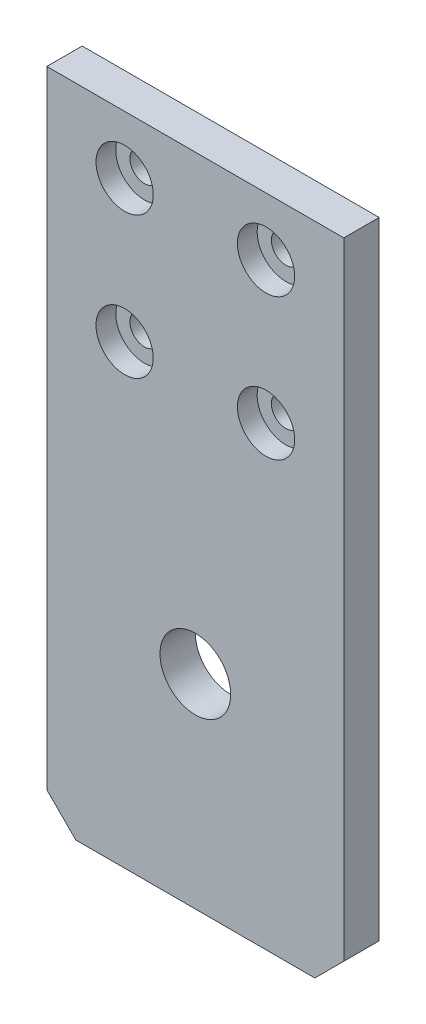
ISO-10303-21;
HEADER;
FILE_DESCRIPTION(('STEP AP214'),'2;1');
FILE_NAME('part.step','',(''),(''),'','','');
FILE_SCHEMA(('AUTOMOTIVE_DESIGN { 1 0 10303 214 1 1 1 1 }'));
ENDSEC;
DATA;
#1=APPLICATION_CONTEXT('core data for automotive mechanical design processes');
#2=APPLICATION_PROTOCOL_DEFINITION('international standard','automotive_design',2000,#1);
#3=PRODUCT_CONTEXT('',#1,'mechanical');
#4=PRODUCT('Part','Part','',(#3));
#5=PRODUCT_RELATED_PRODUCT_CATEGORY('part','',(#4));
#6=PRODUCT_DEFINITION_FORMATION('','',#4);
#7=PRODUCT_DEFINITION_CONTEXT('part definition',#1,'design');
#8=PRODUCT_DEFINITION('design','',#6,#7);
#9=PRODUCT_DEFINITION_SHAPE('','',#8);
#10=(LENGTH_UNIT() NAMED_UNIT(*) SI_UNIT(.MILLI.,.METRE.));
#11=(NAMED_UNIT(*) PLANE_ANGLE_UNIT() SI_UNIT($,.RADIAN.));
#12=(NAMED_UNIT(*) SI_UNIT($,.STERADIAN.) SOLID_ANGLE_UNIT());
#13=UNCERTAINTY_MEASURE_WITH_UNIT(LENGTH_MEASURE(1.E-05),#10,'distance_accuracy_value','');
#14=(GEOMETRIC_REPRESENTATION_CONTEXT(3) GLOBAL_UNCERTAINTY_ASSIGNED_CONTEXT((#13)) GLOBAL_UNIT_ASSIGNED_CONTEXT((#10,
#11,#12)) REPRESENTATION_CONTEXT('',''));
#15=CARTESIAN_POINT('',(0.,0.,0.));
#16=DIRECTION('',(0.,0.,1.));
#17=DIRECTION('',(1.,0.,0.));
#18=AXIS2_PLACEMENT_3D('',#15,#16,#17);
#19=CARTESIAN_POINT('',(31.,76.8,5.));
#20=DIRECTION('',(0.,0.,-1.));
#21=DIRECTION('',(-1.,0.,0.));
#22=AXIS2_PLACEMENT_3D('',#19,#20,#21);
#23=CYLINDRICAL_SURFACE('',#22,2.04999999999999);
#24=CARTESIAN_POINT('',(31.,76.8,0.));
#25=DIRECTION('',(0.,0.,1.));
#26=DIRECTION('',(1.,0.,0.));
#27=AXIS2_PLACEMENT_3D('',#24,#25,#26);
#28=CIRCLE('',#27,2.04999999999999);
#29=CARTESIAN_POINT('',(33.05,76.8,0.));
#30=VERTEX_POINT('',#29);
#31=EDGE_CURVE('E237',#30,#30,#28,.T.);
#32=ORIENTED_EDGE('',*,*,#31,.F.);
#33=EDGE_LOOP('',(#32));
#34=FACE_BOUND('',#33,.T.);
#35=CARTESIAN_POINT('',(31.,76.8,2.2));
#36=DIRECTION('',(0.,0.,1.));
#37=DIRECTION('',(1.,0.,0.));
#38=AXIS2_PLACEMENT_3D('',#35,#36,#37);
#39=CIRCLE('',#38,2.04999999999999);
#40=CARTESIAN_POINT('',(33.05,76.8,2.2));
#41=VERTEX_POINT('',#40);
#42=EDGE_CURVE('E137',#41,#41,#39,.T.);
#43=ORIENTED_EDGE('',*,*,#42,.T.);
#44=EDGE_LOOP('',(#43));
#45=FACE_BOUND('',#44,.T.);
#46=ADVANCED_FACE('F35',(#34,#45),#23,.F.);
#47=CARTESIAN_POINT('',(31.,56.8,5.));
#48=DIRECTION('',(0.,0.,-1.));
#49=DIRECTION('',(-1.,0.,0.));
#50=AXIS2_PLACEMENT_3D('',#47,#48,#49);
#51=CYLINDRICAL_SURFACE('',#50,2.04999999999999);
#52=CARTESIAN_POINT('',(31.,56.8,0.));
#53=DIRECTION('',(0.,0.,1.));
#54=DIRECTION('',(1.,0.,0.));
#55=AXIS2_PLACEMENT_3D('',#52,#53,#54);
#56=CIRCLE('',#55,2.04999999999999);
#57=CARTESIAN_POINT('',(33.05,56.8,0.));
#58=VERTEX_POINT('',#57);
#59=EDGE_CURVE('E234',#58,#58,#56,.T.);
#60=ORIENTED_EDGE('',*,*,#59,.F.);
#61=EDGE_LOOP('',(#60));
#62=FACE_BOUND('',#61,.T.);
#63=CARTESIAN_POINT('',(31.,56.8,2.2));
#64=DIRECTION('',(0.,0.,1.));
#65=DIRECTION('',(1.,0.,0.));
#66=AXIS2_PLACEMENT_3D('',#63,#64,#65);
#67=CIRCLE('',#66,2.04999999999999);
#68=CARTESIAN_POINT('',(33.05,56.8,2.2));
#69=VERTEX_POINT('',#68);
#70=EDGE_CURVE('E132',#69,#69,#67,.T.);
#71=ORIENTED_EDGE('',*,*,#70,.T.);
#72=EDGE_LOOP('',(#71));
#73=FACE_BOUND('',#72,.T.);
#74=ADVANCED_FACE('F175',(#62,#73),#51,.F.);
#75=CARTESIAN_POINT('',(11.,56.8,5.));
#76=DIRECTION('',(0.,0.,-1.));
#77=DIRECTION('',(-1.,0.,0.));
#78=AXIS2_PLACEMENT_3D('',#75,#76,#77);
#79=CYLINDRICAL_SURFACE('',#78,2.05000000000001);
#80=CARTESIAN_POINT('',(11.,56.8,0.));
#81=DIRECTION('',(0.,0.,1.));
#82=DIRECTION('',(1.,0.,0.));
#83=AXIS2_PLACEMENT_3D('',#80,#81,#82);
#84=CIRCLE('',#83,2.05000000000001);
#85=CARTESIAN_POINT('',(13.05,56.8,0.));
#86=VERTEX_POINT('',#85);
#87=EDGE_CURVE('E125',#86,#86,#84,.T.);
#88=ORIENTED_EDGE('',*,*,#87,.F.);
#89=EDGE_LOOP('',(#88));
#90=FACE_BOUND('',#89,.T.);
#91=CARTESIAN_POINT('',(11.,56.8,2.2));
#92=DIRECTION('',(0.,0.,1.));
#93=DIRECTION('',(1.,0.,0.));
#94=AXIS2_PLACEMENT_3D('',#91,#92,#93);
#95=CIRCLE('',#94,2.05000000000001);
#96=CARTESIAN_POINT('',(13.05,56.8,2.2));
#97=VERTEX_POINT('',#96);
#98=EDGE_CURVE('E127',#97,#97,#95,.T.);
#99=ORIENTED_EDGE('',*,*,#98,.T.);
#100=EDGE_LOOP('',(#99));
#101=FACE_BOUND('',#100,.T.);
#102=ADVANCED_FACE('F181',(#90,#101),#79,.F.);
#103=CARTESIAN_POINT('',(11.,76.8,5.));
#104=DIRECTION('',(0.,0.,-1.));
#105=DIRECTION('',(-1.,0.,0.));
#106=AXIS2_PLACEMENT_3D('',#103,#104,#105);
#107=CYLINDRICAL_SURFACE('',#106,2.04999999999999);
#108=CARTESIAN_POINT('',(11.,76.8,0.));
#109=DIRECTION('',(0.,0.,1.));
#110=DIRECTION('',(1.,0.,0.));
#111=AXIS2_PLACEMENT_3D('',#108,#109,#110);
#112=CIRCLE('',#111,2.04999999999999);
#113=CARTESIAN_POINT('',(13.05,76.8,0.));
#114=VERTEX_POINT('',#113);
#115=EDGE_CURVE('E118',#114,#114,#112,.T.);
#116=ORIENTED_EDGE('',*,*,#115,.F.);
#117=EDGE_LOOP('',(#116));
#118=FACE_BOUND('',#117,.T.);
#119=CARTESIAN_POINT('',(11.,76.8,2.2));
#120=DIRECTION('',(0.,0.,1.));
#121=DIRECTION('',(1.,0.,0.));
#122=AXIS2_PLACEMENT_3D('',#119,#120,#121);
#123=CIRCLE('',#122,2.04999999999999);
#124=CARTESIAN_POINT('',(13.05,76.8,2.2));
#125=VERTEX_POINT('',#124);
#126=EDGE_CURVE('E122',#125,#125,#123,.T.);
#127=ORIENTED_EDGE('',*,*,#126,.T.);
#128=EDGE_LOOP('',(#127));
#129=FACE_BOUND('',#128,.T.);
#130=ADVANCED_FACE('F188',(#118,#129),#107,.F.);
#131=CARTESIAN_POINT('',(0.,0.,5.));
#132=DIRECTION('',(0.,0.,1.));
#133=DIRECTION('',(1.,0.,0.));
#134=AXIS2_PLACEMENT_3D('',#131,#132,#133);
#135=PLANE('',#134);
#136=CARTESIAN_POINT('',(21.,21.08,5.));
#137=DIRECTION('',(0.,0.,1.));
#138=DIRECTION('',(1.,0.,0.));
#139=AXIS2_PLACEMENT_3D('',#136,#137,#138);
#140=CIRCLE('',#139,5.);
#141=CARTESIAN_POINT('',(26.,21.08,5.));
#142=VERTEX_POINT('',#141);
#143=EDGE_CURVE('E161',#142,#142,#140,.T.);
#144=ORIENTED_EDGE('',*,*,#143,.F.);
#145=EDGE_LOOP('',(#144));
#146=FACE_BOUND('',#145,.T.);
#147=CARTESIAN_POINT('',(31.,76.8,5.));
#148=DIRECTION('',(0.,0.,1.));
#149=DIRECTION('',(1.,0.,0.));
#150=AXIS2_PLACEMENT_3D('',#147,#148,#149);
#151=CIRCLE('',#150,4.04999999999999);
#152=CARTESIAN_POINT('',(35.05,76.8,5.));
#153=VERTEX_POINT('',#152);
#154=EDGE_CURVE('E213',#153,#153,#151,.T.);
#155=ORIENTED_EDGE('',*,*,#154,.F.);
#156=EDGE_LOOP('',(#155));
#157=FACE_BOUND('',#156,.T.);
#158=CARTESIAN_POINT('',(31.,56.8,5.));
#159=DIRECTION('',(0.,0.,1.));
#160=DIRECTION('',(1.,0.,0.));
#161=AXIS2_PLACEMENT_3D('',#158,#159,#160);
#162=CIRCLE('',#161,4.04999999999999);
#163=CARTESIAN_POINT('',(35.05,56.8,5.));
#164=VERTEX_POINT('',#163);
#165=EDGE_CURVE('E140',#164,#164,#162,.T.);
#166=ORIENTED_EDGE('',*,*,#165,.F.);
#167=EDGE_LOOP('',(#166));
#168=FACE_BOUND('',#167,.T.);
#169=CARTESIAN_POINT('',(11.,56.8,5.));
#170=DIRECTION('',(0.,0.,1.));
#171=DIRECTION('',(1.,0.,0.));
#172=AXIS2_PLACEMENT_3D('',#169,#170,#171);
#173=CIRCLE('',#172,4.05);
#174=CARTESIAN_POINT('',(15.05,56.8,5.));
#175=VERTEX_POINT('',#174);
#176=EDGE_CURVE('E135',#175,#175,#173,.T.);
#177=ORIENTED_EDGE('',*,*,#176,.F.);
#178=EDGE_LOOP('',(#177));
#179=FACE_BOUND('',#178,.T.);
#180=CARTESIAN_POINT('',(11.,76.8,5.));
#181=DIRECTION('',(0.,0.,1.));
#182=DIRECTION('',(1.,0.,0.));
#183=AXIS2_PLACEMENT_3D('',#180,#181,#182);
#184=CIRCLE('',#183,4.05);
#185=CARTESIAN_POINT('',(15.05,76.8,5.));
#186=VERTEX_POINT('',#185);
#187=EDGE_CURVE('E130',#186,#186,#184,.T.);
#188=ORIENTED_EDGE('',*,*,#187,.F.);
#189=EDGE_LOOP('',(#188));
#190=FACE_BOUND('',#189,.T.);
#191=DIRECTION('',(1.,0.,0.));
#192=VECTOR('',#191,1.);
#193=CARTESIAN_POINT('',(0.,-7.7,5.));
#194=LINE('',#193,#192);
#195=CARTESIAN_POINT('',(4.10000000000002,-7.7,5.));
#196=VERTEX_POINT('',#195);
#197=CARTESIAN_POINT('',(37.9,-7.7,5.));
#198=VERTEX_POINT('',#197);
#199=EDGE_CURVE('E162',#196,#198,#194,.T.);
#200=ORIENTED_EDGE('',*,*,#199,.T.);
#201=DIRECTION('',(0.707106781186546,0.707106781186549,0.));
#202=VECTOR('',#201,1.);
#203=CARTESIAN_POINT('',(22.8000000000001,-22.8,5.));
#204=LINE('',#203,#202);
#205=CARTESIAN_POINT('',(42.,-3.59999999999998,5.));
#206=VERTEX_POINT('',#205);
#207=EDGE_CURVE('E97',#198,#206,#204,.T.);
#208=ORIENTED_EDGE('',*,*,#207,.T.);
#209=DIRECTION('',(0.,1.,0.));
#210=VECTOR('',#209,1.);
#211=CARTESIAN_POINT('',(42.,85.,5.));
#212=LINE('',#211,#210);
#213=CARTESIAN_POINT('',(42.,85.,5.));
#214=VERTEX_POINT('',#213);
#215=EDGE_CURVE('E89',#206,#214,#212,.T.);
#216=ORIENTED_EDGE('',*,*,#215,.T.);
#217=DIRECTION('',(-1.,0.,0.));
#218=VECTOR('',#217,1.);
#219=CARTESIAN_POINT('',(0.,85.,5.));
#220=LINE('',#219,#218);
#221=CARTESIAN_POINT('',(0.,85.,5.));
#222=VERTEX_POINT('',#221);
#223=EDGE_CURVE('E95',#214,#222,#220,.T.);
#224=ORIENTED_EDGE('',*,*,#223,.T.);
#225=DIRECTION('',(0.,-1.,0.));
#226=VECTOR('',#225,1.);
#227=CARTESIAN_POINT('',(0.,85.,5.));
#228=LINE('',#227,#226);
#229=CARTESIAN_POINT('',(0.,-3.6,5.));
#230=VERTEX_POINT('',#229);
#231=EDGE_CURVE('E98',#222,#230,#228,.T.);
#232=ORIENTED_EDGE('',*,*,#231,.T.);
#233=DIRECTION('',(0.707106781186549,-0.707106781186546,0.));
#234=VECTOR('',#233,1.);
#235=CARTESIAN_POINT('',(-1.8,-1.8,5.));
#236=LINE('',#235,#234);
#237=EDGE_CURVE('E146',#230,#196,#236,.T.);
#238=ORIENTED_EDGE('',*,*,#237,.T.);
#239=EDGE_LOOP('',(#200,#208,#216,#224,#232,#238));
#240=FACE_BOUND('',#239,.T.);
#241=ADVANCED_FACE('F92',(#146,#157,#168,#179,#190,#240),#135,.T.);
#242=CARTESIAN_POINT('',(0.,0.,0.));
#243=DIRECTION('',(0.,0.,1.));
#244=DIRECTION('',(1.,0.,0.));
#245=AXIS2_PLACEMENT_3D('',#242,#243,#244);
#246=PLANE('',#245);
#247=CARTESIAN_POINT('',(21.,21.08,0.));
#248=DIRECTION('',(0.,0.,1.));
#249=DIRECTION('',(1.,0.,0.));
#250=AXIS2_PLACEMENT_3D('',#247,#248,#249);
#251=CIRCLE('',#250,5.);
#252=CARTESIAN_POINT('',(26.,21.08,0.));
#253=VERTEX_POINT('',#252);
#254=EDGE_CURVE('E210',#253,#253,#251,.T.);
#255=ORIENTED_EDGE('',*,*,#254,.T.);
#256=EDGE_LOOP('',(#255));
#257=FACE_BOUND('',#256,.T.);
#258=DIRECTION('',(0.,1.,0.));
#259=VECTOR('',#258,1.);
#260=CARTESIAN_POINT('',(42.,85.,0.));
#261=LINE('',#260,#259);
#262=CARTESIAN_POINT('',(42.,-3.59999999999997,0.));
#263=VERTEX_POINT('',#262);
#264=CARTESIAN_POINT('',(42.,85.,0.));
#265=VERTEX_POINT('',#264);
#266=EDGE_CURVE('E103',#263,#265,#261,.T.);
#267=ORIENTED_EDGE('',*,*,#266,.F.);
#268=DIRECTION('',(-0.707106781186546,-0.707106781186549,0.));
#269=VECTOR('',#268,1.);
#270=CARTESIAN_POINT('',(37.9,-7.7,0.));
#271=LINE('',#270,#269);
#272=CARTESIAN_POINT('',(37.9,-7.7,0.));
#273=VERTEX_POINT('',#272);
#274=EDGE_CURVE('E43',#263,#273,#271,.T.);
#275=ORIENTED_EDGE('',*,*,#274,.T.);
#276=DIRECTION('',(1.,0.,0.));
#277=VECTOR('',#276,1.);
#278=CARTESIAN_POINT('',(0.,-7.7,0.));
#279=LINE('',#278,#277);
#280=CARTESIAN_POINT('',(4.10000000000002,-7.7,0.));
#281=VERTEX_POINT('',#280);
#282=EDGE_CURVE('E154',#281,#273,#279,.T.);
#283=ORIENTED_EDGE('',*,*,#282,.F.);
#284=DIRECTION('',(-0.707106781186549,0.707106781186546,0.));
#285=VECTOR('',#284,1.);
#286=CARTESIAN_POINT('',(0.,-3.59999999999999,0.));
#287=LINE('',#286,#285);
#288=CARTESIAN_POINT('',(0.,-3.6,0.));
#289=VERTEX_POINT('',#288);
#290=EDGE_CURVE('E50',#281,#289,#287,.T.);
#291=ORIENTED_EDGE('',*,*,#290,.T.);
#292=DIRECTION('',(0.,-1.,0.));
#293=VECTOR('',#292,1.);
#294=CARTESIAN_POINT('',(0.,85.,0.));
#295=LINE('',#294,#293);
#296=CARTESIAN_POINT('',(0.,85.,0.));
#297=VERTEX_POINT('',#296);
#298=EDGE_CURVE('E116',#297,#289,#295,.T.);
#299=ORIENTED_EDGE('',*,*,#298,.F.);
#300=DIRECTION('',(-1.,0.,0.));
#301=VECTOR('',#300,1.);
#302=CARTESIAN_POINT('',(0.,85.,0.));
#303=LINE('',#302,#301);
#304=EDGE_CURVE('E120',#265,#297,#303,.T.);
#305=ORIENTED_EDGE('',*,*,#304,.F.);
#306=EDGE_LOOP('',(#267,#275,#283,#291,#299,#305));
#307=FACE_BOUND('',#306,.T.);
#308=ORIENTED_EDGE('',*,*,#115,.T.);
#309=EDGE_LOOP('',(#308));
#310=FACE_BOUND('',#309,.T.);
#311=ORIENTED_EDGE('',*,*,#31,.T.);
#312=EDGE_LOOP('',(#311));
#313=FACE_BOUND('',#312,.T.);
#314=ORIENTED_EDGE('',*,*,#59,.T.);
#315=EDGE_LOOP('',(#314));
#316=FACE_BOUND('',#315,.T.);
#317=ORIENTED_EDGE('',*,*,#87,.T.);
#318=EDGE_LOOP('',(#317));
#319=FACE_BOUND('',#318,.T.);
#320=ADVANCED_FACE('F152',(#257,#307,#310,#313,#316,#319),#246,.F.);
#321=CARTESIAN_POINT('',(0.,85.,5.));
#322=DIRECTION('',(1.,0.,0.));
#323=DIRECTION('',(0.,1.,0.));
#324=AXIS2_PLACEMENT_3D('',#321,#322,#323);
#325=PLANE('',#324);
#326=ORIENTED_EDGE('',*,*,#298,.T.);
#327=DIRECTION('',(0.,0.,1.));
#328=VECTOR('',#327,1.);
#329=CARTESIAN_POINT('',(0.,-3.59999999999999,5.));
#330=LINE('',#329,#328);
#331=EDGE_CURVE('E11',#289,#230,#330,.T.);
#332=ORIENTED_EDGE('',*,*,#331,.T.);
#333=ORIENTED_EDGE('',*,*,#231,.F.);
#334=DIRECTION('',(0.,0.,-1.));
#335=VECTOR('',#334,1.);
#336=CARTESIAN_POINT('',(0.,85.,5.));
#337=LINE('',#336,#335);
#338=EDGE_CURVE('E107',#222,#297,#337,.T.);
#339=ORIENTED_EDGE('',*,*,#338,.T.);
#340=EDGE_LOOP('',(#326,#332,#333,#339));
#341=FACE_BOUND('',#340,.T.);
#342=ADVANCED_FACE('F197',(#341),#325,.F.);
#343=CARTESIAN_POINT('',(42.,85.,5.));
#344=DIRECTION('',(-1.,0.,0.));
#345=DIRECTION('',(0.,0.,1.));
#346=AXIS2_PLACEMENT_3D('',#343,#344,#345);
#347=PLANE('',#346);
#348=ORIENTED_EDGE('',*,*,#215,.F.);
#349=DIRECTION('',(0.,0.,-1.));
#350=VECTOR('',#349,1.);
#351=CARTESIAN_POINT('',(42.,-3.59999999999998,0.));
#352=LINE('',#351,#350);
#353=EDGE_CURVE('E58',#206,#263,#352,.T.);
#354=ORIENTED_EDGE('',*,*,#353,.T.);
#355=ORIENTED_EDGE('',*,*,#266,.T.);
#356=DIRECTION('',(0.,0.,-1.));
#357=VECTOR('',#356,1.);
#358=CARTESIAN_POINT('',(42.,85.,5.));
#359=LINE('',#358,#357);
#360=EDGE_CURVE('E101',#214,#265,#359,.T.);
#361=ORIENTED_EDGE('',*,*,#360,.F.);
#362=EDGE_LOOP('',(#348,#354,#355,#361));
#363=FACE_BOUND('',#362,.T.);
#364=ADVANCED_FACE('F102',(#363),#347,.F.);
#365=CARTESIAN_POINT('',(0.,85.,5.));
#366=DIRECTION('',(0.,-1.,0.));
#367=DIRECTION('',(0.,0.,-1.));
#368=AXIS2_PLACEMENT_3D('',#365,#366,#367);
#369=PLANE('',#368);
#370=ORIENTED_EDGE('',*,*,#304,.T.);
#371=ORIENTED_EDGE('',*,*,#338,.F.);
#372=ORIENTED_EDGE('',*,*,#223,.F.);
#373=ORIENTED_EDGE('',*,*,#360,.T.);
#374=EDGE_LOOP('',(#370,#371,#372,#373));
#375=FACE_BOUND('',#374,.T.);
#376=ADVANCED_FACE('F109',(#375),#369,.F.);
#377=CARTESIAN_POINT('',(11.,76.8,2.2));
#378=DIRECTION('',(0.,0.,1.));
#379=DIRECTION('',(1.,0.,0.));
#380=AXIS2_PLACEMENT_3D('',#377,#378,#379);
#381=CYLINDRICAL_SURFACE('',#380,4.05);
#382=CARTESIAN_POINT('',(11.,76.8,2.2));
#383=DIRECTION('',(0.,0.,1.));
#384=DIRECTION('',(1.,0.,0.));
#385=AXIS2_PLACEMENT_3D('',#382,#383,#384);
#386=CIRCLE('',#385,4.05);
#387=CARTESIAN_POINT('',(15.05,76.8,2.2));
#388=VERTEX_POINT('',#387);
#389=EDGE_CURVE('E126',#388,#388,#386,.T.);
#390=ORIENTED_EDGE('',*,*,#389,.F.);
#391=EDGE_LOOP('',(#390));
#392=FACE_BOUND('',#391,.T.);
#393=ORIENTED_EDGE('',*,*,#187,.T.);
#394=EDGE_LOOP('',(#393));
#395=FACE_BOUND('',#394,.T.);
#396=ADVANCED_FACE('F201',(#392,#395),#381,.F.);
#397=CARTESIAN_POINT('',(11.,76.8,2.2));
#398=DIRECTION('',(0.,0.,1.));
#399=DIRECTION('',(1.,0.,0.));
#400=AXIS2_PLACEMENT_3D('',#397,#398,#399);
#401=PLANE('',#400);
#402=ORIENTED_EDGE('',*,*,#126,.F.);
#403=EDGE_LOOP('',(#402));
#404=FACE_BOUND('',#403,.T.);
#405=ORIENTED_EDGE('',*,*,#389,.T.);
#406=EDGE_LOOP('',(#405));
#407=FACE_BOUND('',#406,.T.);
#408=ADVANCED_FACE('F246',(#404,#407),#401,.T.);
#409=CARTESIAN_POINT('',(11.,56.8,2.2));
#410=DIRECTION('',(0.,0.,1.));
#411=DIRECTION('',(1.,0.,0.));
#412=AXIS2_PLACEMENT_3D('',#409,#410,#411);
#413=CYLINDRICAL_SURFACE('',#412,4.05);
#414=CARTESIAN_POINT('',(11.,56.8,2.2));
#415=DIRECTION('',(0.,0.,1.));
#416=DIRECTION('',(1.,0.,0.));
#417=AXIS2_PLACEMENT_3D('',#414,#415,#416);
#418=CIRCLE('',#417,4.05);
#419=CARTESIAN_POINT('',(15.05,56.8,2.2));
#420=VERTEX_POINT('',#419);
#421=EDGE_CURVE('E131',#420,#420,#418,.T.);
#422=ORIENTED_EDGE('',*,*,#421,.F.);
#423=EDGE_LOOP('',(#422));
#424=FACE_BOUND('',#423,.T.);
#425=ORIENTED_EDGE('',*,*,#176,.T.);
#426=EDGE_LOOP('',(#425));
#427=FACE_BOUND('',#426,.T.);
#428=ADVANCED_FACE('F249',(#424,#427),#413,.F.);
#429=CARTESIAN_POINT('',(11.,56.8,2.2));
#430=DIRECTION('',(0.,0.,1.));
#431=DIRECTION('',(1.,0.,0.));
#432=AXIS2_PLACEMENT_3D('',#429,#430,#431);
#433=PLANE('',#432);
#434=ORIENTED_EDGE('',*,*,#98,.F.);
#435=EDGE_LOOP('',(#434));
#436=FACE_BOUND('',#435,.T.);
#437=ORIENTED_EDGE('',*,*,#421,.T.);
#438=EDGE_LOOP('',(#437));
#439=FACE_BOUND('',#438,.T.);
#440=ADVANCED_FACE('F269',(#436,#439),#433,.T.);
#441=CARTESIAN_POINT('',(31.,56.8,2.2));
#442=DIRECTION('',(0.,0.,1.));
#443=DIRECTION('',(1.,0.,0.));
#444=AXIS2_PLACEMENT_3D('',#441,#442,#443);
#445=CYLINDRICAL_SURFACE('',#444,4.04999999999999);
#446=CARTESIAN_POINT('',(31.,56.8,2.2));
#447=DIRECTION('',(0.,0.,1.));
#448=DIRECTION('',(1.,0.,0.));
#449=AXIS2_PLACEMENT_3D('',#446,#447,#448);
#450=CIRCLE('',#449,4.04999999999999);
#451=CARTESIAN_POINT('',(35.05,56.8,2.2));
#452=VERTEX_POINT('',#451);
#453=EDGE_CURVE('E136',#452,#452,#450,.T.);
#454=ORIENTED_EDGE('',*,*,#453,.F.);
#455=EDGE_LOOP('',(#454));
#456=FACE_BOUND('',#455,.T.);
#457=ORIENTED_EDGE('',*,*,#165,.T.);
#458=EDGE_LOOP('',(#457));
#459=FACE_BOUND('',#458,.T.);
#460=ADVANCED_FACE('F272',(#456,#459),#445,.F.);
#461=CARTESIAN_POINT('',(31.,56.8,2.2));
#462=DIRECTION('',(0.,0.,1.));
#463=DIRECTION('',(1.,0.,0.));
#464=AXIS2_PLACEMENT_3D('',#461,#462,#463);
#465=PLANE('',#464);
#466=ORIENTED_EDGE('',*,*,#70,.F.);
#467=EDGE_LOOP('',(#466));
#468=FACE_BOUND('',#467,.T.);
#469=ORIENTED_EDGE('',*,*,#453,.T.);
#470=EDGE_LOOP('',(#469));
#471=FACE_BOUND('',#470,.T.);
#472=ADVANCED_FACE('F285',(#468,#471),#465,.T.);
#473=CARTESIAN_POINT('',(31.,76.8,2.2));
#474=DIRECTION('',(0.,0.,1.));
#475=DIRECTION('',(1.,0.,0.));
#476=AXIS2_PLACEMENT_3D('',#473,#474,#475);
#477=CYLINDRICAL_SURFACE('',#476,4.04999999999999);
#478=CARTESIAN_POINT('',(31.,76.8,2.2));
#479=DIRECTION('',(0.,0.,1.));
#480=DIRECTION('',(1.,0.,0.));
#481=AXIS2_PLACEMENT_3D('',#478,#479,#480);
#482=CIRCLE('',#481,4.04999999999999);
#483=CARTESIAN_POINT('',(35.05,76.8,2.2));
#484=VERTEX_POINT('',#483);
#485=EDGE_CURVE('E141',#484,#484,#482,.T.);
#486=ORIENTED_EDGE('',*,*,#485,.F.);
#487=EDGE_LOOP('',(#486));
#488=FACE_BOUND('',#487,.T.);
#489=ORIENTED_EDGE('',*,*,#154,.T.);
#490=EDGE_LOOP('',(#489));
#491=FACE_BOUND('',#490,.T.);
#492=ADVANCED_FACE('F289',(#488,#491),#477,.F.);
#493=CARTESIAN_POINT('',(31.,76.8,2.2));
#494=DIRECTION('',(0.,0.,1.));
#495=DIRECTION('',(1.,0.,0.));
#496=AXIS2_PLACEMENT_3D('',#493,#494,#495);
#497=PLANE('',#496);
#498=ORIENTED_EDGE('',*,*,#42,.F.);
#499=EDGE_LOOP('',(#498));
#500=FACE_BOUND('',#499,.T.);
#501=ORIENTED_EDGE('',*,*,#485,.T.);
#502=EDGE_LOOP('',(#501));
#503=FACE_BOUND('',#502,.T.);
#504=ADVANCED_FACE('F293',(#500,#503),#497,.T.);
#505=CARTESIAN_POINT('',(21.,21.08,0.));
#506=DIRECTION('',(0.,0.,1.));
#507=DIRECTION('',(1.,0.,0.));
#508=AXIS2_PLACEMENT_3D('',#505,#506,#507);
#509=CYLINDRICAL_SURFACE('',#508,5.);
#510=ORIENTED_EDGE('',*,*,#254,.F.);
#511=EDGE_LOOP('',(#510));
#512=FACE_BOUND('',#511,.T.);
#513=ORIENTED_EDGE('',*,*,#143,.T.);
#514=EDGE_LOOP('',(#513));
#515=FACE_BOUND('',#514,.T.);
#516=ADVANCED_FACE('F171',(#512,#515),#509,.F.);
#517=CARTESIAN_POINT('',(0.,-7.7,0.));
#518=DIRECTION('',(0.,-1.,0.));
#519=DIRECTION('',(0.,0.,-1.));
#520=AXIS2_PLACEMENT_3D('',#517,#518,#519);
#521=PLANE('',#520);
#522=ORIENTED_EDGE('',*,*,#282,.T.);
#523=DIRECTION('',(0.,0.,1.));
#524=VECTOR('',#523,1.);
#525=CARTESIAN_POINT('',(37.9,-7.7,5.));
#526=LINE('',#525,#524);
#527=EDGE_CURVE('E143',#273,#198,#526,.T.);
#528=ORIENTED_EDGE('',*,*,#527,.T.);
#529=ORIENTED_EDGE('',*,*,#199,.F.);
#530=DIRECTION('',(0.,0.,-1.));
#531=VECTOR('',#530,1.);
#532=CARTESIAN_POINT('',(4.10000000000002,-7.7,0.));
#533=LINE('',#532,#531);
#534=EDGE_CURVE('E106',#196,#281,#533,.T.);
#535=ORIENTED_EDGE('',*,*,#534,.T.);
#536=EDGE_LOOP('',(#522,#528,#529,#535));
#537=FACE_BOUND('',#536,.T.);
#538=ADVANCED_FACE('F158',(#537),#521,.T.);
#539=CARTESIAN_POINT('',(37.9,-7.7,0.));
#540=DIRECTION('',(0.707106781186549,-0.707106781186546,0.));
#541=DIRECTION('',(0.,0.,-1.));
#542=AXIS2_PLACEMENT_3D('',#539,#540,#541);
#543=PLANE('',#542);
#544=ORIENTED_EDGE('',*,*,#274,.F.);
#545=ORIENTED_EDGE('',*,*,#353,.F.);
#546=ORIENTED_EDGE('',*,*,#207,.F.);
#547=ORIENTED_EDGE('',*,*,#527,.F.);
#548=EDGE_LOOP('',(#544,#545,#546,#547));
#549=FACE_BOUND('',#548,.T.);
#550=ADVANCED_FACE('F164',(#549),#543,.T.);
#551=CARTESIAN_POINT('',(0.,-3.59999999999999,5.));
#552=DIRECTION('',(-0.707106781186546,-0.707106781186549,0.));
#553=DIRECTION('',(0.,0.,-1.));
#554=AXIS2_PLACEMENT_3D('',#551,#552,#553);
#555=PLANE('',#554);
#556=ORIENTED_EDGE('',*,*,#290,.F.);
#557=ORIENTED_EDGE('',*,*,#534,.F.);
#558=ORIENTED_EDGE('',*,*,#237,.F.);
#559=ORIENTED_EDGE('',*,*,#331,.F.);
#560=EDGE_LOOP('',(#556,#557,#558,#559));
#561=FACE_BOUND('',#560,.T.);
#562=ADVANCED_FACE('F37',(#561),#555,.T.);
#563=CLOSED_SHELL('',(#46,#74,#102,#130,#241,#320,#342,#364,#376,#396,#408,#428,#440,#460,#472,
#492,#504,#516,#538,#550,#562));
#564=MANIFOLD_SOLID_BREP('B2',#563);
#565=ADVANCED_BREP_SHAPE_REPRESENTATION('',(#18,#564),#14);
#566=SHAPE_DEFINITION_REPRESENTATION(#9,#565);
ENDSEC;
END-ISO-10303-21;
